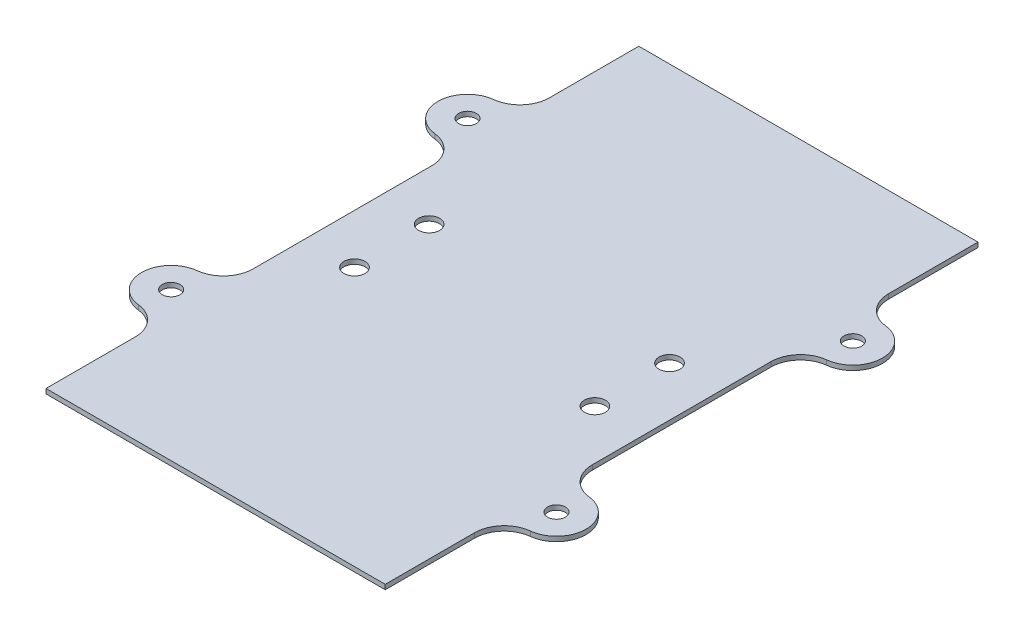
ISO-10303-21;
HEADER;
FILE_DESCRIPTION(('STEP AP214'),'2;1');
FILE_NAME('part.step','',(''),(''),'','','');
FILE_SCHEMA(('AUTOMOTIVE_DESIGN { 1 0 10303 214 1 1 1 1 }'));
ENDSEC;
DATA;
#1=APPLICATION_CONTEXT('core data for automotive mechanical design processes');
#2=APPLICATION_PROTOCOL_DEFINITION('international standard','automotive_design',2000,#1);
#3=PRODUCT_CONTEXT('',#1,'mechanical');
#4=PRODUCT('Part','Part','',(#3));
#5=PRODUCT_RELATED_PRODUCT_CATEGORY('part','',(#4));
#6=PRODUCT_DEFINITION_FORMATION('','',#4);
#7=PRODUCT_DEFINITION_CONTEXT('part definition',#1,'design');
#8=PRODUCT_DEFINITION('design','',#6,#7);
#9=PRODUCT_DEFINITION_SHAPE('','',#8);
#10=(LENGTH_UNIT() NAMED_UNIT(*) SI_UNIT(.MILLI.,.METRE.));
#11=(NAMED_UNIT(*) PLANE_ANGLE_UNIT() SI_UNIT($,.RADIAN.));
#12=(NAMED_UNIT(*) SI_UNIT($,.STERADIAN.) SOLID_ANGLE_UNIT());
#13=UNCERTAINTY_MEASURE_WITH_UNIT(LENGTH_MEASURE(1.E-05),#10,'distance_accuracy_value','');
#14=(GEOMETRIC_REPRESENTATION_CONTEXT(3) GLOBAL_UNCERTAINTY_ASSIGNED_CONTEXT((#13)) GLOBAL_UNIT_ASSIGNED_CONTEXT((#10,
#11,#12)) REPRESENTATION_CONTEXT('',''));
#15=CARTESIAN_POINT('',(0.,0.,0.));
#16=DIRECTION('',(0.,0.,1.));
#17=DIRECTION('',(1.,0.,0.));
#18=AXIS2_PLACEMENT_3D('',#15,#16,#17);
#19=CARTESIAN_POINT('',(-75.3282434819132,1.016,-62.9305095305058));
#20=DIRECTION('',(1.,0.,0.));
#21=DIRECTION('',(0.,0.,-1.));
#22=AXIS2_PLACEMENT_3D('',#19,#20,#21);
#23=PLANE('',#22);
#24=DIRECTION('',(0.,0.,1.));
#25=VECTOR('',#24,1.);
#26=CARTESIAN_POINT('',(-75.3282434819132,1.016,-62.9305095305058));
#27=LINE('',#26,#25);
#28=CARTESIAN_POINT('',(-75.3282434819132,1.016,-18.5593034173802));
#29=VERTEX_POINT('',#28);
#30=CARTESIAN_POINT('',(-75.3282434819132,1.016,19.6982843563685));
#31=VERTEX_POINT('',#30);
#32=EDGE_CURVE('E182',#29,#31,#27,.T.);
#33=ORIENTED_EDGE('',*,*,#32,.F.);
#34=DIRECTION('',(0.,1.,0.));
#35=VECTOR('',#34,1.);
#36=CARTESIAN_POINT('',(-75.3282434819132,1.016,-18.5593034173802));
#37=LINE('',#36,#35);
#38=CARTESIAN_POINT('',(-75.3282434819132,0.,-18.5593034173802));
#39=VERTEX_POINT('',#38);
#40=EDGE_CURVE('E248',#29,#39,#37,.F.);
#41=ORIENTED_EDGE('',*,*,#40,.T.);
#42=DIRECTION('',(0.,0.,1.));
#43=VECTOR('',#42,1.);
#44=CARTESIAN_POINT('',(-75.3282434819132,0.,-62.9305095305058));
#45=LINE('',#44,#43);
#46=CARTESIAN_POINT('',(-75.3282434819132,0.,19.6982843563685));
#47=VERTEX_POINT('',#46);
#48=EDGE_CURVE('E213',#39,#47,#45,.T.);
#49=ORIENTED_EDGE('',*,*,#48,.T.);
#50=DIRECTION('',(0.,1.,0.));
#51=VECTOR('',#50,1.);
#52=CARTESIAN_POINT('',(-75.3282434819132,1.016,19.6982843563685));
#53=LINE('',#52,#51);
#54=EDGE_CURVE('E234',#47,#31,#53,.T.);
#55=ORIENTED_EDGE('',*,*,#54,.T.);
#56=EDGE_LOOP('',(#33,#41,#49,#55));
#57=FACE_BOUND('',#56,.T.);
#58=ADVANCED_FACE('F34',(#57),#23,.F.);
#59=CARTESIAN_POINT('',(-2.65324348191322,1.016,-62.9305095305058));
#60=DIRECTION('',(-1.,0.,0.));
#61=DIRECTION('',(0.,0.,1.));
#62=AXIS2_PLACEMENT_3D('',#59,#60,#61);
#63=PLANE('',#62);
#64=DIRECTION('',(0.,0.,-1.));
#65=VECTOR('',#64,1.);
#66=CARTESIAN_POINT('',(-2.65324348191322,0.,-62.9305095305058));
#67=LINE('',#66,#65);
#68=CARTESIAN_POINT('',(-2.6532434819132,0.,64.0694904694942));
#69=VERTEX_POINT('',#68);
#70=CARTESIAN_POINT('',(-2.65324348191321,0.,44.9406965826198));
#71=VERTEX_POINT('',#70);
#72=EDGE_CURVE('E283',#69,#71,#67,.T.);
#73=ORIENTED_EDGE('',*,*,#72,.T.);
#74=DIRECTION('',(0.,1.,0.));
#75=VECTOR('',#74,1.);
#76=CARTESIAN_POINT('',(-2.65324348191321,1.016,44.9406965826198));
#77=LINE('',#76,#75);
#78=CARTESIAN_POINT('',(-2.65324348191321,1.016,44.9406965826198));
#79=VERTEX_POINT('',#78);
#80=EDGE_CURVE('E357',#71,#79,#77,.T.);
#81=ORIENTED_EDGE('',*,*,#80,.T.);
#82=DIRECTION('',(0.,0.,-1.));
#83=VECTOR('',#82,1.);
#84=CARTESIAN_POINT('',(-2.65324348191322,1.016,-62.9305095305058));
#85=LINE('',#84,#83);
#86=CARTESIAN_POINT('',(-2.6532434819132,1.016,64.0694904694942));
#87=VERTEX_POINT('',#86);
#88=EDGE_CURVE('E281',#87,#79,#85,.T.);
#89=ORIENTED_EDGE('',*,*,#88,.F.);
#90=DIRECTION('',(0.,-1.,0.));
#91=VECTOR('',#90,1.);
#92=CARTESIAN_POINT('',(-2.6532434819132,1.016,64.0694904694942));
#93=LINE('',#92,#91);
#94=EDGE_CURVE('E190',#87,#69,#93,.T.);
#95=ORIENTED_EDGE('',*,*,#94,.T.);
#96=EDGE_LOOP('',(#73,#81,#89,#95));
#97=FACE_BOUND('',#96,.T.);
#98=ADVANCED_FACE('F434',(#97),#63,.F.);
#99=CARTESIAN_POINT('',(-2.65324348191322,1.016,-43.8017156436315));
#100=VERTEX_POINT('',#99);
#101=CARTESIAN_POINT('',(-2.65324348191322,1.016,-62.9305095305058));
#102=VERTEX_POINT('',#101);
#103=EDGE_CURVE('E192',#100,#102,#85,.T.);
#104=ORIENTED_EDGE('',*,*,#103,.F.);
#105=DIRECTION('',(0.,1.,0.));
#106=VECTOR('',#105,1.);
#107=CARTESIAN_POINT('',(-2.65324348191322,1.016,-43.8017156436315));
#108=LINE('',#107,#106);
#109=CARTESIAN_POINT('',(-2.65324348191322,0.,-43.8017156436315));
#110=VERTEX_POINT('',#109);
#111=EDGE_CURVE('E307',#100,#110,#108,.F.);
#112=ORIENTED_EDGE('',*,*,#111,.T.);
#113=CARTESIAN_POINT('',(-2.65324348191322,0.,-62.9305095305058));
#114=VERTEX_POINT('',#113);
#115=EDGE_CURVE('E296',#110,#114,#67,.T.);
#116=ORIENTED_EDGE('',*,*,#115,.T.);
#117=DIRECTION('',(0.,-1.,0.));
#118=VECTOR('',#117,1.);
#119=CARTESIAN_POINT('',(-2.65324348191322,1.016,-62.9305095305058));
#120=LINE('',#119,#118);
#121=EDGE_CURVE('E204',#102,#114,#120,.T.);
#122=ORIENTED_EDGE('',*,*,#121,.F.);
#123=EDGE_LOOP('',(#104,#112,#116,#122));
#124=FACE_BOUND('',#123,.T.);
#125=ADVANCED_FACE('F440',(#124),#63,.F.);
#126=CARTESIAN_POINT('',(-75.3282434819132,1.016,44.9406965826198));
#127=VERTEX_POINT('',#126);
#128=CARTESIAN_POINT('',(-75.3282434819132,1.016,64.0694904694942));
#129=VERTEX_POINT('',#128);
#130=EDGE_CURVE('E170',#127,#129,#27,.T.);
#131=ORIENTED_EDGE('',*,*,#130,.F.);
#132=DIRECTION('',(0.,1.,0.));
#133=VECTOR('',#132,1.);
#134=CARTESIAN_POINT('',(-75.3282434819132,1.016,44.9406965826198));
#135=LINE('',#134,#133);
#136=CARTESIAN_POINT('',(-75.3282434819132,0.,44.9406965826198));
#137=VERTEX_POINT('',#136);
#138=EDGE_CURVE('E245',#127,#137,#135,.F.);
#139=ORIENTED_EDGE('',*,*,#138,.T.);
#140=CARTESIAN_POINT('',(-75.3282434819132,0.,64.0694904694942));
#141=VERTEX_POINT('',#140);
#142=EDGE_CURVE('E197',#137,#141,#45,.T.);
#143=ORIENTED_EDGE('',*,*,#142,.T.);
#144=DIRECTION('',(0.,-1.,0.));
#145=VECTOR('',#144,1.);
#146=CARTESIAN_POINT('',(-75.3282434819132,1.016,64.0694904694942));
#147=LINE('',#146,#145);
#148=EDGE_CURVE('E188',#129,#141,#147,.T.);
#149=ORIENTED_EDGE('',*,*,#148,.F.);
#150=EDGE_LOOP('',(#131,#139,#143,#149));
#151=FACE_BOUND('',#150,.T.);
#152=ADVANCED_FACE('F195',(#151),#23,.F.);
#153=CARTESIAN_POINT('',(-75.3282434819132,0.,-62.9305095305058));
#154=VERTEX_POINT('',#153);
#155=CARTESIAN_POINT('',(-75.3282434819132,0.,-43.8017156436315));
#156=VERTEX_POINT('',#155);
#157=EDGE_CURVE('E208',#154,#156,#45,.T.);
#158=ORIENTED_EDGE('',*,*,#157,.T.);
#159=DIRECTION('',(0.,1.,0.));
#160=VECTOR('',#159,1.);
#161=CARTESIAN_POINT('',(-75.3282434819132,1.016,-43.8017156436315));
#162=LINE('',#161,#160);
#163=CARTESIAN_POINT('',(-75.3282434819132,1.016,-43.8017156436315));
#164=VERTEX_POINT('',#163);
#165=EDGE_CURVE('E199',#156,#164,#162,.T.);
#166=ORIENTED_EDGE('',*,*,#165,.T.);
#167=CARTESIAN_POINT('',(-75.3282434819132,1.016,-62.9305095305058));
#168=VERTEX_POINT('',#167);
#169=EDGE_CURVE('E193',#168,#164,#27,.T.);
#170=ORIENTED_EDGE('',*,*,#169,.F.);
#171=DIRECTION('',(0.,-1.,0.));
#172=VECTOR('',#171,1.);
#173=CARTESIAN_POINT('',(-75.3282434819132,1.016,-62.9305095305058));
#174=LINE('',#173,#172);
#175=EDGE_CURVE('E456',#168,#154,#174,.T.);
#176=ORIENTED_EDGE('',*,*,#175,.T.);
#177=EDGE_LOOP('',(#158,#166,#170,#176));
#178=FACE_BOUND('',#177,.T.);
#179=ADVANCED_FACE('F436',(#178),#23,.F.);
#180=CARTESIAN_POINT('',(-75.3282434819132,1.016,64.0694904694942));
#181=DIRECTION('',(0.,0.,-1.));
#182=DIRECTION('',(-1.,0.,0.));
#183=AXIS2_PLACEMENT_3D('',#180,#181,#182);
#184=PLANE('',#183);
#185=DIRECTION('',(1.,0.,0.));
#186=VECTOR('',#185,1.);
#187=CARTESIAN_POINT('',(-75.3282434819132,0.,64.0694904694942));
#188=LINE('',#187,#186);
#189=EDGE_CURVE('E212',#141,#69,#188,.T.);
#190=ORIENTED_EDGE('',*,*,#189,.T.);
#191=ORIENTED_EDGE('',*,*,#94,.F.);
#192=DIRECTION('',(1.,0.,0.));
#193=VECTOR('',#192,1.);
#194=CARTESIAN_POINT('',(-75.3282434819132,1.016,64.0694904694942));
#195=LINE('',#194,#193);
#196=EDGE_CURVE('E175',#129,#87,#195,.T.);
#197=ORIENTED_EDGE('',*,*,#196,.F.);
#198=ORIENTED_EDGE('',*,*,#148,.T.);
#199=EDGE_LOOP('',(#190,#191,#197,#198));
#200=FACE_BOUND('',#199,.T.);
#201=ADVANCED_FACE('F187',(#200),#184,.F.);
#202=CARTESIAN_POINT('',(-2.65324348191321,0.,19.6982843563685));
#203=VERTEX_POINT('',#202);
#204=CARTESIAN_POINT('',(-2.65324348191321,0.,-18.5593034173802));
#205=VERTEX_POINT('',#204);
#206=EDGE_CURVE('E293',#203,#205,#67,.T.);
#207=ORIENTED_EDGE('',*,*,#206,.T.);
#208=DIRECTION('',(0.,1.,0.));
#209=VECTOR('',#208,1.);
#210=CARTESIAN_POINT('',(-2.65324348191321,1.016,-18.5593034173802));
#211=LINE('',#210,#209);
#212=CARTESIAN_POINT('',(-2.65324348191321,1.016,-18.5593034173802));
#213=VERTEX_POINT('',#212);
#214=EDGE_CURVE('E310',#205,#213,#211,.T.);
#215=ORIENTED_EDGE('',*,*,#214,.T.);
#216=CARTESIAN_POINT('',(-2.65324348191321,1.016,19.6982843563685));
#217=VERTEX_POINT('',#216);
#218=EDGE_CURVE('E282',#217,#213,#85,.T.);
#219=ORIENTED_EDGE('',*,*,#218,.F.);
#220=DIRECTION('',(0.,1.,0.));
#221=VECTOR('',#220,1.);
#222=CARTESIAN_POINT('',(-2.65324348191321,1.016,19.6982843563685));
#223=LINE('',#222,#221);
#224=EDGE_CURVE('E297',#217,#203,#223,.F.);
#225=ORIENTED_EDGE('',*,*,#224,.T.);
#226=EDGE_LOOP('',(#207,#215,#219,#225));
#227=FACE_BOUND('',#226,.T.);
#228=ADVANCED_FACE('F443',(#227),#63,.F.);
#229=CARTESIAN_POINT('',(-75.3282434819132,1.016,-62.9305095305058));
#230=DIRECTION('',(0.,0.,1.));
#231=DIRECTION('',(1.,0.,0.));
#232=AXIS2_PLACEMENT_3D('',#229,#230,#231);
#233=PLANE('',#232);
#234=DIRECTION('',(-1.,0.,0.));
#235=VECTOR('',#234,1.);
#236=CARTESIAN_POINT('',(-75.3282434819132,0.,-62.9305095305058));
#237=LINE('',#236,#235);
#238=EDGE_CURVE('E183',#114,#154,#237,.T.);
#239=ORIENTED_EDGE('',*,*,#238,.T.);
#240=ORIENTED_EDGE('',*,*,#175,.F.);
#241=DIRECTION('',(-1.,0.,0.));
#242=VECTOR('',#241,1.);
#243=CARTESIAN_POINT('',(-75.3282434819132,1.016,-62.9305095305058));
#244=LINE('',#243,#242);
#245=EDGE_CURVE('E219',#102,#168,#244,.T.);
#246=ORIENTED_EDGE('',*,*,#245,.F.);
#247=ORIENTED_EDGE('',*,*,#121,.T.);
#248=EDGE_LOOP('',(#239,#240,#246,#247));
#249=FACE_BOUND('',#248,.T.);
#250=ADVANCED_FACE('F428',(#249),#233,.F.);
#251=CARTESIAN_POINT('',(0.,1.016,0.));
#252=DIRECTION('',(0.,1.,0.));
#253=DIRECTION('',(0.,0.,1.));
#254=AXIS2_PLACEMENT_3D('',#251,#252,#253);
#255=PLANE('',#254);
#256=CARTESIAN_POINT('',(-80.2657434819132,1.016,-31.1805095305058));
#257=DIRECTION('',(0.,1.,0.));
#258=DIRECTION('',(0.,0.,1.));
#259=AXIS2_PLACEMENT_3D('',#256,#257,#258);
#260=CIRCLE('',#259,1.89864999999999);
#261=CARTESIAN_POINT('',(-80.2657434819132,1.016,-29.2818595305058));
#262=VERTEX_POINT('',#261);
#263=EDGE_CURVE('E268',#262,#262,#260,.T.);
#264=ORIENTED_EDGE('',*,*,#263,.F.);
#265=EDGE_LOOP('',(#264));
#266=FACE_BOUND('',#265,.T.);
#267=CARTESIAN_POINT('',(-80.2657434819132,1.016,32.3194904694942));
#268=DIRECTION('',(0.,1.,0.));
#269=DIRECTION('',(0.,0.,1.));
#270=AXIS2_PLACEMENT_3D('',#267,#268,#269);
#271=CIRCLE('',#270,1.89864999999999);
#272=CARTESIAN_POINT('',(-80.2657434819132,1.016,34.2181404694942));
#273=VERTEX_POINT('',#272);
#274=EDGE_CURVE('E267',#273,#273,#271,.T.);
#275=ORIENTED_EDGE('',*,*,#274,.F.);
#276=EDGE_LOOP('',(#275));
#277=FACE_BOUND('',#276,.T.);
#278=CARTESIAN_POINT('',(2.28425651808681,1.016,32.3194904694942));
#279=DIRECTION('',(0.,1.,0.));
#280=DIRECTION('',(0.,0.,1.));
#281=AXIS2_PLACEMENT_3D('',#278,#279,#280);
#282=CIRCLE('',#281,1.89864999999999);
#283=CARTESIAN_POINT('',(2.28425651808681,1.016,34.2181404694942));
#284=VERTEX_POINT('',#283);
#285=EDGE_CURVE('E272',#284,#284,#282,.T.);
#286=ORIENTED_EDGE('',*,*,#285,.F.);
#287=EDGE_LOOP('',(#286));
#288=FACE_BOUND('',#287,.T.);
#289=CARTESIAN_POINT('',(2.28425651808677,1.016,-31.1805095305058));
#290=DIRECTION('',(0.,1.,0.));
#291=DIRECTION('',(0.,0.,1.));
#292=AXIS2_PLACEMENT_3D('',#289,#290,#291);
#293=CIRCLE('',#292,1.89864999999999);
#294=CARTESIAN_POINT('',(2.28425651808677,1.016,-29.2818595305058));
#295=VERTEX_POINT('',#294);
#296=EDGE_CURVE('E276',#295,#295,#293,.T.);
#297=ORIENTED_EDGE('',*,*,#296,.F.);
#298=EDGE_LOOP('',(#297));
#299=FACE_BOUND('',#298,.T.);
#300=CARTESIAN_POINT('',(-13.2407434819132,1.016,8.56949046949416));
#301=DIRECTION('',(0.,-1.,0.));
#302=DIRECTION('',(0.,0.,-1.));
#303=AXIS2_PLACEMENT_3D('',#300,#301,#302);
#304=CIRCLE('',#303,2.25000000000001);
#305=CARTESIAN_POINT('',(-13.2407434819132,1.016,6.31949046949415));
#306=VERTEX_POINT('',#305);
#307=EDGE_CURVE('E394',#306,#306,#304,.T.);
#308=ORIENTED_EDGE('',*,*,#307,.T.);
#309=EDGE_LOOP('',(#308));
#310=FACE_BOUND('',#309,.T.);
#311=CARTESIAN_POINT('',(-13.2407434819132,1.016,-7.43050953050584));
#312=DIRECTION('',(0.,-1.,0.));
#313=DIRECTION('',(0.,0.,-1.));
#314=AXIS2_PLACEMENT_3D('',#311,#312,#313);
#315=CIRCLE('',#314,2.25000000000001);
#316=CARTESIAN_POINT('',(-13.2407434819132,1.016,-9.68050953050585));
#317=VERTEX_POINT('',#316);
#318=EDGE_CURVE('E400',#317,#317,#315,.T.);
#319=ORIENTED_EDGE('',*,*,#318,.T.);
#320=EDGE_LOOP('',(#319));
#321=FACE_BOUND('',#320,.T.);
#322=CARTESIAN_POINT('',(-64.7407434819132,1.016,-7.43050953050583));
#323=DIRECTION('',(0.,-1.,0.));
#324=DIRECTION('',(0.,0.,-1.));
#325=AXIS2_PLACEMENT_3D('',#322,#323,#324);
#326=CIRCLE('',#325,2.25000000000001);
#327=CARTESIAN_POINT('',(-64.7407434819132,1.016,-9.68050953050584));
#328=VERTEX_POINT('',#327);
#329=EDGE_CURVE('E406',#328,#328,#326,.T.);
#330=ORIENTED_EDGE('',*,*,#329,.T.);
#331=EDGE_LOOP('',(#330));
#332=FACE_BOUND('',#331,.T.);
#333=CARTESIAN_POINT('',(-64.7407434819132,1.016,8.56949046949417));
#334=DIRECTION('',(0.,-1.,0.));
#335=DIRECTION('',(0.,0.,-1.));
#336=AXIS2_PLACEMENT_3D('',#333,#334,#335);
#337=CIRCLE('',#336,2.25000000000001);
#338=CARTESIAN_POINT('',(-64.7407434819132,1.016,6.31949046949416));
#339=VERTEX_POINT('',#338);
#340=EDGE_CURVE('E324',#339,#339,#337,.T.);
#341=ORIENTED_EDGE('',*,*,#340,.T.);
#342=EDGE_LOOP('',(#341));
#343=FACE_BOUND('',#342,.T.);
#344=ORIENTED_EDGE('',*,*,#169,.T.);
#345=CARTESIAN_POINT('',(-81.6782434819132,1.016,-43.8017156436315));
#346=DIRECTION('',(0.,1.,0.));
#347=DIRECTION('',(0.,0.,1.));
#348=AXIS2_PLACEMENT_3D('',#345,#346,#347);
#349=CIRCLE('',#348,6.35);
#350=CARTESIAN_POINT('',(-80.9719934819132,1.016,-37.4911125870686));
#351=VERTEX_POINT('',#350);
#352=EDGE_CURVE('E361',#164,#351,#349,.F.);
#353=ORIENTED_EDGE('',*,*,#352,.T.);
#354=CARTESIAN_POINT('',(-80.2657434819132,1.016,-31.1805095305058));
#355=DIRECTION('',(0.,1.,0.));
#356=DIRECTION('',(0.,0.,1.));
#357=AXIS2_PLACEMENT_3D('',#354,#355,#356);
#358=CIRCLE('',#357,6.35);
#359=CARTESIAN_POINT('',(-80.9719934819132,1.016,-24.869906473943));
#360=VERTEX_POINT('',#359);
#361=EDGE_CURVE('E387',#351,#360,#358,.T.);
#362=ORIENTED_EDGE('',*,*,#361,.T.);
#363=CARTESIAN_POINT('',(-81.6782434819132,1.016,-18.5593034173802));
#364=DIRECTION('',(0.,1.,0.));
#365=DIRECTION('',(0.,0.,1.));
#366=AXIS2_PLACEMENT_3D('',#363,#364,#365);
#367=CIRCLE('',#366,6.35);
#368=EDGE_CURVE('E365',#360,#29,#367,.F.);
#369=ORIENTED_EDGE('',*,*,#368,.T.);
#370=ORIENTED_EDGE('',*,*,#32,.T.);
#371=CARTESIAN_POINT('',(-81.6782434819132,1.016,19.6982843563685));
#372=DIRECTION('',(0.,1.,0.));
#373=DIRECTION('',(0.,0.,1.));
#374=AXIS2_PLACEMENT_3D('',#371,#372,#373);
#375=CIRCLE('',#374,6.35);
#376=CARTESIAN_POINT('',(-80.9719934819132,1.016,26.0088874129314));
#377=VERTEX_POINT('',#376);
#378=EDGE_CURVE('E369',#31,#377,#375,.F.);
#379=ORIENTED_EDGE('',*,*,#378,.T.);
#380=CARTESIAN_POINT('',(-80.2657434819132,1.016,32.3194904694942));
#381=DIRECTION('',(0.,1.,0.));
#382=DIRECTION('',(0.,0.,-1.));
#383=AXIS2_PLACEMENT_3D('',#380,#381,#382);
#384=CIRCLE('',#383,6.35);
#385=CARTESIAN_POINT('',(-80.9719934819132,1.016,38.630093526057));
#386=VERTEX_POINT('',#385);
#387=EDGE_CURVE('E280',#377,#386,#384,.T.);
#388=ORIENTED_EDGE('',*,*,#387,.T.);
#389=CARTESIAN_POINT('',(-81.6782434819132,1.016,44.9406965826198));
#390=DIRECTION('',(0.,1.,0.));
#391=DIRECTION('',(0.,0.,1.));
#392=AXIS2_PLACEMENT_3D('',#389,#390,#391);
#393=CIRCLE('',#392,6.35);
#394=EDGE_CURVE('E178',#386,#127,#393,.F.);
#395=ORIENTED_EDGE('',*,*,#394,.T.);
#396=ORIENTED_EDGE('',*,*,#130,.T.);
#397=ORIENTED_EDGE('',*,*,#196,.T.);
#398=ORIENTED_EDGE('',*,*,#88,.T.);
#399=CARTESIAN_POINT('',(3.69675651808679,1.016,44.9406965826198));
#400=DIRECTION('',(0.,1.,0.));
#401=DIRECTION('',(0.,0.,1.));
#402=AXIS2_PLACEMENT_3D('',#399,#400,#401);
#403=CIRCLE('',#402,6.35);
#404=CARTESIAN_POINT('',(2.9905065180868,1.016,38.630093526057));
#405=VERTEX_POINT('',#404);
#406=EDGE_CURVE('E42',#79,#405,#403,.F.);
#407=ORIENTED_EDGE('',*,*,#406,.T.);
#408=CARTESIAN_POINT('',(2.28425651808681,1.016,32.3194904694942));
#409=DIRECTION('',(0.,1.,0.));
#410=DIRECTION('',(0.,0.,1.));
#411=AXIS2_PLACEMENT_3D('',#408,#409,#410);
#412=CIRCLE('',#411,6.35);
#413=CARTESIAN_POINT('',(2.9905065180868,1.016,26.0088874129314));
#414=VERTEX_POINT('',#413);
#415=EDGE_CURVE('E345',#405,#414,#412,.T.);
#416=ORIENTED_EDGE('',*,*,#415,.T.);
#417=CARTESIAN_POINT('',(3.69675651808679,1.016,19.6982843563685));
#418=DIRECTION('',(0.,1.,0.));
#419=DIRECTION('',(0.,0.,1.));
#420=AXIS2_PLACEMENT_3D('',#417,#418,#419);
#421=CIRCLE('',#420,6.35);
#422=EDGE_CURVE('E340',#414,#217,#421,.F.);
#423=ORIENTED_EDGE('',*,*,#422,.T.);
#424=ORIENTED_EDGE('',*,*,#218,.T.);
#425=CARTESIAN_POINT('',(3.69675651808679,1.016,-18.5593034173802));
#426=DIRECTION('',(0.,1.,0.));
#427=DIRECTION('',(0.,0.,1.));
#428=AXIS2_PLACEMENT_3D('',#425,#426,#427);
#429=CIRCLE('',#428,6.35);
#430=CARTESIAN_POINT('',(2.99050651808678,1.016,-24.869906473943));
#431=VERTEX_POINT('',#430);
#432=EDGE_CURVE('E327',#213,#431,#429,.F.);
#433=ORIENTED_EDGE('',*,*,#432,.T.);
#434=CARTESIAN_POINT('',(2.28425651808677,1.016,-31.1805095305058));
#435=DIRECTION('',(0.,1.,0.));
#436=DIRECTION('',(0.,0.,-1.));
#437=AXIS2_PLACEMENT_3D('',#434,#435,#436);
#438=CIRCLE('',#437,6.35);
#439=CARTESIAN_POINT('',(2.99050651808677,1.016,-37.4911125870686));
#440=VERTEX_POINT('',#439);
#441=EDGE_CURVE('E382',#431,#440,#438,.T.);
#442=ORIENTED_EDGE('',*,*,#441,.T.);
#443=CARTESIAN_POINT('',(3.69675651808678,1.016,-43.8017156436315));
#444=DIRECTION('',(0.,1.,0.));
#445=DIRECTION('',(0.,0.,1.));
#446=AXIS2_PLACEMENT_3D('',#443,#444,#445);
#447=CIRCLE('',#446,6.35);
#448=EDGE_CURVE('E336',#440,#100,#447,.F.);
#449=ORIENTED_EDGE('',*,*,#448,.T.);
#450=ORIENTED_EDGE('',*,*,#103,.T.);
#451=ORIENTED_EDGE('',*,*,#245,.T.);
#452=EDGE_LOOP('',(#344,#353,#362,#369,#370,#379,#388,#395,#396,#397,#398,#407,#416,#423,#424,
#433,#442,#449,#450,#451));
#453=FACE_BOUND('',#452,.T.);
#454=ADVANCED_FACE('F173',(#266,#277,#288,#299,#310,#321,#332,#343,#453),#255,.T.);
#455=CARTESIAN_POINT('',(0.,0.,0.));
#456=DIRECTION('',(0.,1.,0.));
#457=DIRECTION('',(0.,0.,1.));
#458=AXIS2_PLACEMENT_3D('',#455,#456,#457);
#459=PLANE('',#458);
#460=CARTESIAN_POINT('',(-80.2657434819132,0.,-31.1805095305058));
#461=DIRECTION('',(0.,1.,0.));
#462=DIRECTION('',(0.,0.,1.));
#463=AXIS2_PLACEMENT_3D('',#460,#461,#462);
#464=CIRCLE('',#463,1.89864999999999);
#465=CARTESIAN_POINT('',(-80.2657434819132,0.,-29.2818595305058));
#466=VERTEX_POINT('',#465);
#467=EDGE_CURVE('E264',#466,#466,#464,.T.);
#468=ORIENTED_EDGE('',*,*,#467,.T.);
#469=EDGE_LOOP('',(#468));
#470=FACE_BOUND('',#469,.T.);
#471=CARTESIAN_POINT('',(-80.2657434819132,0.,32.3194904694942));
#472=DIRECTION('',(0.,1.,0.));
#473=DIRECTION('',(0.,0.,1.));
#474=AXIS2_PLACEMENT_3D('',#471,#472,#473);
#475=CIRCLE('',#474,1.89864999999999);
#476=CARTESIAN_POINT('',(-80.2657434819132,0.,34.2181404694942));
#477=VERTEX_POINT('',#476);
#478=EDGE_CURVE('E269',#477,#477,#475,.T.);
#479=ORIENTED_EDGE('',*,*,#478,.T.);
#480=EDGE_LOOP('',(#479));
#481=FACE_BOUND('',#480,.T.);
#482=CARTESIAN_POINT('',(2.28425651808681,0.,32.3194904694942));
#483=DIRECTION('',(0.,1.,0.));
#484=DIRECTION('',(0.,0.,1.));
#485=AXIS2_PLACEMENT_3D('',#482,#483,#484);
#486=CIRCLE('',#485,1.89864999999999);
#487=CARTESIAN_POINT('',(2.28425651808681,0.,34.2181404694942));
#488=VERTEX_POINT('',#487);
#489=EDGE_CURVE('E273',#488,#488,#486,.T.);
#490=ORIENTED_EDGE('',*,*,#489,.T.);
#491=EDGE_LOOP('',(#490));
#492=FACE_BOUND('',#491,.T.);
#493=CARTESIAN_POINT('',(2.28425651808677,0.,-31.1805095305058));
#494=DIRECTION('',(0.,1.,0.));
#495=DIRECTION('',(0.,0.,1.));
#496=AXIS2_PLACEMENT_3D('',#493,#494,#495);
#497=CIRCLE('',#496,1.89864999999999);
#498=CARTESIAN_POINT('',(2.28425651808677,0.,-29.2818595305058));
#499=VERTEX_POINT('',#498);
#500=EDGE_CURVE('E277',#499,#499,#497,.T.);
#501=ORIENTED_EDGE('',*,*,#500,.T.);
#502=EDGE_LOOP('',(#501));
#503=FACE_BOUND('',#502,.T.);
#504=CARTESIAN_POINT('',(-13.2407434819132,0.,8.56949046949416));
#505=DIRECTION('',(0.,-1.,0.));
#506=DIRECTION('',(0.,0.,-1.));
#507=AXIS2_PLACEMENT_3D('',#504,#505,#506);
#508=CIRCLE('',#507,2.25000000000001);
#509=CARTESIAN_POINT('',(-13.2407434819132,0.,6.31949046949415));
#510=VERTEX_POINT('',#509);
#511=EDGE_CURVE('E392',#510,#510,#508,.T.);
#512=ORIENTED_EDGE('',*,*,#511,.F.);
#513=EDGE_LOOP('',(#512));
#514=FACE_BOUND('',#513,.T.);
#515=CARTESIAN_POINT('',(-13.2407434819132,0.,-7.43050953050584));
#516=DIRECTION('',(0.,-1.,0.));
#517=DIRECTION('',(0.,0.,-1.));
#518=AXIS2_PLACEMENT_3D('',#515,#516,#517);
#519=CIRCLE('',#518,2.25000000000001);
#520=CARTESIAN_POINT('',(-13.2407434819132,0.,-9.68050953050585));
#521=VERTEX_POINT('',#520);
#522=EDGE_CURVE('E397',#521,#521,#519,.T.);
#523=ORIENTED_EDGE('',*,*,#522,.F.);
#524=EDGE_LOOP('',(#523));
#525=FACE_BOUND('',#524,.T.);
#526=CARTESIAN_POINT('',(-64.7407434819132,0.,-7.43050953050583));
#527=DIRECTION('',(0.,-1.,0.));
#528=DIRECTION('',(0.,0.,-1.));
#529=AXIS2_PLACEMENT_3D('',#526,#527,#528);
#530=CIRCLE('',#529,2.25000000000001);
#531=CARTESIAN_POINT('',(-64.7407434819132,0.,-9.68050953050584));
#532=VERTEX_POINT('',#531);
#533=EDGE_CURVE('E403',#532,#532,#530,.T.);
#534=ORIENTED_EDGE('',*,*,#533,.F.);
#535=EDGE_LOOP('',(#534));
#536=FACE_BOUND('',#535,.T.);
#537=CARTESIAN_POINT('',(-64.7407434819132,0.,8.56949046949417));
#538=DIRECTION('',(0.,-1.,0.));
#539=DIRECTION('',(0.,0.,-1.));
#540=AXIS2_PLACEMENT_3D('',#537,#538,#539);
#541=CIRCLE('',#540,2.25000000000001);
#542=CARTESIAN_POINT('',(-64.7407434819132,0.,6.31949046949416));
#543=VERTEX_POINT('',#542);
#544=EDGE_CURVE('E238',#543,#543,#541,.T.);
#545=ORIENTED_EDGE('',*,*,#544,.F.);
#546=EDGE_LOOP('',(#545));
#547=FACE_BOUND('',#546,.T.);
#548=ORIENTED_EDGE('',*,*,#157,.F.);
#549=ORIENTED_EDGE('',*,*,#238,.F.);
#550=ORIENTED_EDGE('',*,*,#115,.F.);
#551=CARTESIAN_POINT('',(3.69675651808678,0.,-43.8017156436315));
#552=DIRECTION('',(0.,1.,0.));
#553=DIRECTION('',(0.,0.,1.));
#554=AXIS2_PLACEMENT_3D('',#551,#552,#553);
#555=CIRCLE('',#554,6.35);
#556=CARTESIAN_POINT('',(2.99050651808677,0.,-37.4911125870686));
#557=VERTEX_POINT('',#556);
#558=EDGE_CURVE('E338',#110,#557,#555,.T.);
#559=ORIENTED_EDGE('',*,*,#558,.T.);
#560=CARTESIAN_POINT('',(2.28425651808677,0.,-31.1805095305058));
#561=DIRECTION('',(0.,1.,0.));
#562=DIRECTION('',(0.,0.,1.));
#563=AXIS2_PLACEMENT_3D('',#560,#561,#562);
#564=CIRCLE('',#563,6.35);
#565=CARTESIAN_POINT('',(2.99050651808678,0.,-24.869906473943));
#566=VERTEX_POINT('',#565);
#567=EDGE_CURVE('E384',#557,#566,#564,.F.);
#568=ORIENTED_EDGE('',*,*,#567,.T.);
#569=CARTESIAN_POINT('',(3.69675651808679,0.,-18.5593034173802));
#570=DIRECTION('',(0.,1.,0.));
#571=DIRECTION('',(0.,0.,1.));
#572=AXIS2_PLACEMENT_3D('',#569,#570,#571);
#573=CIRCLE('',#572,6.35);
#574=EDGE_CURVE('E329',#566,#205,#573,.T.);
#575=ORIENTED_EDGE('',*,*,#574,.T.);
#576=ORIENTED_EDGE('',*,*,#206,.F.);
#577=CARTESIAN_POINT('',(3.69675651808679,0.,19.6982843563685));
#578=DIRECTION('',(0.,1.,0.));
#579=DIRECTION('',(0.,0.,1.));
#580=AXIS2_PLACEMENT_3D('',#577,#578,#579);
#581=CIRCLE('',#580,6.35);
#582=CARTESIAN_POINT('',(2.9905065180868,0.,26.0088874129314));
#583=VERTEX_POINT('',#582);
#584=EDGE_CURVE('E342',#203,#583,#581,.T.);
#585=ORIENTED_EDGE('',*,*,#584,.T.);
#586=CARTESIAN_POINT('',(2.28425651808681,0.,32.3194904694942));
#587=DIRECTION('',(0.,1.,0.));
#588=DIRECTION('',(0.,0.,1.));
#589=AXIS2_PLACEMENT_3D('',#586,#587,#588);
#590=CIRCLE('',#589,6.35);
#591=CARTESIAN_POINT('',(2.9905065180868,0.,38.630093526057));
#592=VERTEX_POINT('',#591);
#593=EDGE_CURVE('E353',#583,#592,#590,.F.);
#594=ORIENTED_EDGE('',*,*,#593,.T.);
#595=CARTESIAN_POINT('',(3.69675651808679,0.,44.9406965826198));
#596=DIRECTION('',(0.,1.,0.));
#597=DIRECTION('',(0.,0.,1.));
#598=AXIS2_PLACEMENT_3D('',#595,#596,#597);
#599=CIRCLE('',#598,6.35);
#600=EDGE_CURVE('E11',#592,#71,#599,.T.);
#601=ORIENTED_EDGE('',*,*,#600,.T.);
#602=ORIENTED_EDGE('',*,*,#72,.F.);
#603=ORIENTED_EDGE('',*,*,#189,.F.);
#604=ORIENTED_EDGE('',*,*,#142,.F.);
#605=CARTESIAN_POINT('',(-81.6782434819132,0.,44.9406965826198));
#606=DIRECTION('',(0.,1.,0.));
#607=DIRECTION('',(0.,0.,1.));
#608=AXIS2_PLACEMENT_3D('',#605,#606,#607);
#609=CIRCLE('',#608,6.35);
#610=CARTESIAN_POINT('',(-80.9719934819132,0.,38.630093526057));
#611=VERTEX_POINT('',#610);
#612=EDGE_CURVE('E322',#137,#611,#609,.T.);
#613=ORIENTED_EDGE('',*,*,#612,.T.);
#614=CARTESIAN_POINT('',(-80.2657434819132,0.,32.3194904694942));
#615=DIRECTION('',(0.,1.,0.));
#616=DIRECTION('',(0.,0.,1.));
#617=AXIS2_PLACEMENT_3D('',#614,#615,#616);
#618=CIRCLE('',#617,6.35);
#619=CARTESIAN_POINT('',(-80.9719934819132,0.,26.0088874129314));
#620=VERTEX_POINT('',#619);
#621=EDGE_CURVE('E354',#611,#620,#618,.F.);
#622=ORIENTED_EDGE('',*,*,#621,.T.);
#623=CARTESIAN_POINT('',(-81.6782434819132,0.,19.6982843563685));
#624=DIRECTION('',(0.,1.,0.));
#625=DIRECTION('',(0.,0.,1.));
#626=AXIS2_PLACEMENT_3D('',#623,#624,#625);
#627=CIRCLE('',#626,6.35);
#628=EDGE_CURVE('E331',#620,#47,#627,.T.);
#629=ORIENTED_EDGE('',*,*,#628,.T.);
#630=ORIENTED_EDGE('',*,*,#48,.F.);
#631=CARTESIAN_POINT('',(-81.6782434819132,0.,-18.5593034173802));
#632=DIRECTION('',(0.,1.,0.));
#633=DIRECTION('',(0.,0.,1.));
#634=AXIS2_PLACEMENT_3D('',#631,#632,#633);
#635=CIRCLE('',#634,6.35);
#636=CARTESIAN_POINT('',(-80.9719934819132,0.,-24.869906473943));
#637=VERTEX_POINT('',#636);
#638=EDGE_CURVE('E367',#39,#637,#635,.T.);
#639=ORIENTED_EDGE('',*,*,#638,.T.);
#640=CARTESIAN_POINT('',(-80.2657434819132,0.,-31.1805095305058));
#641=DIRECTION('',(0.,1.,0.));
#642=DIRECTION('',(0.,0.,1.));
#643=AXIS2_PLACEMENT_3D('',#640,#641,#642);
#644=CIRCLE('',#643,6.35);
#645=CARTESIAN_POINT('',(-80.9719934819132,0.,-37.4911125870686));
#646=VERTEX_POINT('',#645);
#647=EDGE_CURVE('E390',#637,#646,#644,.F.);
#648=ORIENTED_EDGE('',*,*,#647,.T.);
#649=CARTESIAN_POINT('',(-81.6782434819132,0.,-43.8017156436315));
#650=DIRECTION('',(0.,1.,0.));
#651=DIRECTION('',(0.,0.,1.));
#652=AXIS2_PLACEMENT_3D('',#649,#650,#651);
#653=CIRCLE('',#652,6.35);
#654=EDGE_CURVE('E363',#646,#156,#653,.T.);
#655=ORIENTED_EDGE('',*,*,#654,.T.);
#656=EDGE_LOOP('',(#548,#549,#550,#559,#568,#575,#576,#585,#594,#601,#602,#603,#604,#613,#622,
#629,#630,#639,#648,#655));
#657=FACE_BOUND('',#656,.T.);
#658=ADVANCED_FACE('F320',(#470,#481,#492,#503,#514,#525,#536,#547,#657),#459,.F.);
#659=CARTESIAN_POINT('',(-64.7407434819132,1.016,8.56949046949417));
#660=DIRECTION('',(0.,-1.,0.));
#661=DIRECTION('',(0.,0.,-1.));
#662=AXIS2_PLACEMENT_3D('',#659,#660,#661);
#663=CYLINDRICAL_SURFACE('',#662,2.25000000000001);
#664=ORIENTED_EDGE('',*,*,#340,.F.);
#665=EDGE_LOOP('',(#664));
#666=FACE_BOUND('',#665,.T.);
#667=ORIENTED_EDGE('',*,*,#544,.T.);
#668=EDGE_LOOP('',(#667));
#669=FACE_BOUND('',#668,.T.);
#670=ADVANCED_FACE('F416',(#666,#669),#663,.F.);
#671=CARTESIAN_POINT('',(-64.7407434819132,1.016,-7.43050953050583));
#672=DIRECTION('',(0.,-1.,0.));
#673=DIRECTION('',(0.,0.,-1.));
#674=AXIS2_PLACEMENT_3D('',#671,#672,#673);
#675=CYLINDRICAL_SURFACE('',#674,2.25000000000001);
#676=ORIENTED_EDGE('',*,*,#329,.F.);
#677=EDGE_LOOP('',(#676));
#678=FACE_BOUND('',#677,.T.);
#679=ORIENTED_EDGE('',*,*,#533,.T.);
#680=EDGE_LOOP('',(#679));
#681=FACE_BOUND('',#680,.T.);
#682=ADVANCED_FACE('F425',(#678,#681),#675,.F.);
#683=CARTESIAN_POINT('',(-13.2407434819132,1.016,-7.43050953050584));
#684=DIRECTION('',(0.,-1.,0.));
#685=DIRECTION('',(0.,0.,-1.));
#686=AXIS2_PLACEMENT_3D('',#683,#684,#685);
#687=CYLINDRICAL_SURFACE('',#686,2.25000000000001);
#688=ORIENTED_EDGE('',*,*,#318,.F.);
#689=EDGE_LOOP('',(#688));
#690=FACE_BOUND('',#689,.T.);
#691=ORIENTED_EDGE('',*,*,#522,.T.);
#692=EDGE_LOOP('',(#691));
#693=FACE_BOUND('',#692,.T.);
#694=ADVANCED_FACE('F472',(#690,#693),#687,.F.);
#695=CARTESIAN_POINT('',(-13.2407434819132,1.016,8.56949046949416));
#696=DIRECTION('',(0.,-1.,0.));
#697=DIRECTION('',(0.,0.,-1.));
#698=AXIS2_PLACEMENT_3D('',#695,#696,#697);
#699=CYLINDRICAL_SURFACE('',#698,2.25000000000001);
#700=ORIENTED_EDGE('',*,*,#307,.F.);
#701=EDGE_LOOP('',(#700));
#702=FACE_BOUND('',#701,.T.);
#703=ORIENTED_EDGE('',*,*,#511,.T.);
#704=EDGE_LOOP('',(#703));
#705=FACE_BOUND('',#704,.T.);
#706=ADVANCED_FACE('F464',(#702,#705),#699,.F.);
#707=CARTESIAN_POINT('',(-80.2657434819132,-16.9911052097855,-31.1805095305058));
#708=DIRECTION('',(0.,1.,0.));
#709=DIRECTION('',(0.,0.,1.));
#710=AXIS2_PLACEMENT_3D('',#707,#708,#709);
#711=CYLINDRICAL_SURFACE('',#710,6.35);
#712=ORIENTED_EDGE('',*,*,#361,.F.);
#713=DIRECTION('',(0.,1.,0.));
#714=VECTOR('',#713,1.);
#715=CARTESIAN_POINT('',(-80.9719934819132,-16.9911052097855,-37.4911125870686));
#716=LINE('',#715,#714);
#717=EDGE_CURVE('E230',#351,#646,#716,.F.);
#718=ORIENTED_EDGE('',*,*,#717,.T.);
#719=ORIENTED_EDGE('',*,*,#647,.F.);
#720=DIRECTION('',(0.,1.,0.));
#721=VECTOR('',#720,1.);
#722=CARTESIAN_POINT('',(-80.9719934819132,-16.9911052097855,-24.869906473943));
#723=LINE('',#722,#721);
#724=EDGE_CURVE('E202',#637,#360,#723,.T.);
#725=ORIENTED_EDGE('',*,*,#724,.T.);
#726=EDGE_LOOP('',(#712,#718,#719,#725));
#727=FACE_BOUND('',#726,.T.);
#728=ADVANCED_FACE('F461',(#727),#711,.T.);
#729=CARTESIAN_POINT('',(2.28425651808677,-16.9911052097855,-31.1805095305058));
#730=DIRECTION('',(0.,1.,0.));
#731=DIRECTION('',(0.,0.,1.));
#732=AXIS2_PLACEMENT_3D('',#729,#730,#731);
#733=CYLINDRICAL_SURFACE('',#732,6.35);
#734=ORIENTED_EDGE('',*,*,#441,.F.);
#735=DIRECTION('',(0.,1.,0.));
#736=VECTOR('',#735,1.);
#737=CARTESIAN_POINT('',(2.99050651808678,-16.9911052097855,-24.869906473943));
#738=LINE('',#737,#736);
#739=EDGE_CURVE('E305',#431,#566,#738,.F.);
#740=ORIENTED_EDGE('',*,*,#739,.T.);
#741=ORIENTED_EDGE('',*,*,#567,.F.);
#742=DIRECTION('',(0.,1.,0.));
#743=VECTOR('',#742,1.);
#744=CARTESIAN_POINT('',(2.99050651808677,-16.9911052097855,-37.4911125870686));
#745=LINE('',#744,#743);
#746=EDGE_CURVE('E308',#557,#440,#745,.T.);
#747=ORIENTED_EDGE('',*,*,#746,.T.);
#748=EDGE_LOOP('',(#734,#740,#741,#747));
#749=FACE_BOUND('',#748,.T.);
#750=ADVANCED_FACE('F463',(#749),#733,.T.);
#751=CARTESIAN_POINT('',(2.28425651808681,-16.9911052097855,32.3194904694942));
#752=DIRECTION('',(0.,1.,0.));
#753=DIRECTION('',(0.,0.,1.));
#754=AXIS2_PLACEMENT_3D('',#751,#752,#753);
#755=CYLINDRICAL_SURFACE('',#754,6.35);
#756=ORIENTED_EDGE('',*,*,#593,.F.);
#757=DIRECTION('',(0.,1.,0.));
#758=VECTOR('',#757,1.);
#759=CARTESIAN_POINT('',(2.9905065180868,-16.9911052097855,26.0088874129314));
#760=LINE('',#759,#758);
#761=EDGE_CURVE('E352',#583,#414,#760,.T.);
#762=ORIENTED_EDGE('',*,*,#761,.T.);
#763=ORIENTED_EDGE('',*,*,#415,.F.);
#764=DIRECTION('',(0.,1.,0.));
#765=VECTOR('',#764,1.);
#766=CARTESIAN_POINT('',(2.9905065180868,-16.9911052097855,38.630093526057));
#767=LINE('',#766,#765);
#768=EDGE_CURVE('E350',#405,#592,#767,.F.);
#769=ORIENTED_EDGE('',*,*,#768,.T.);
#770=EDGE_LOOP('',(#756,#762,#763,#769));
#771=FACE_BOUND('',#770,.T.);
#772=ADVANCED_FACE('F349',(#771),#755,.T.);
#773=CARTESIAN_POINT('',(-80.2657434819132,-16.9911052097855,32.3194904694942));
#774=DIRECTION('',(0.,1.,0.));
#775=DIRECTION('',(0.,0.,1.));
#776=AXIS2_PLACEMENT_3D('',#773,#774,#775);
#777=CYLINDRICAL_SURFACE('',#776,6.35);
#778=ORIENTED_EDGE('',*,*,#387,.F.);
#779=DIRECTION('',(0.,1.,0.));
#780=VECTOR('',#779,1.);
#781=CARTESIAN_POINT('',(-80.9719934819132,-16.9911052097855,26.0088874129314));
#782=LINE('',#781,#780);
#783=EDGE_CURVE('E243',#377,#620,#782,.F.);
#784=ORIENTED_EDGE('',*,*,#783,.T.);
#785=ORIENTED_EDGE('',*,*,#621,.F.);
#786=DIRECTION('',(0.,1.,0.));
#787=VECTOR('',#786,1.);
#788=CARTESIAN_POINT('',(-80.9719934819132,-16.9911052097855,38.630093526057));
#789=LINE('',#788,#787);
#790=EDGE_CURVE('E246',#611,#386,#789,.T.);
#791=ORIENTED_EDGE('',*,*,#790,.T.);
#792=EDGE_LOOP('',(#778,#784,#785,#791));
#793=FACE_BOUND('',#792,.T.);
#794=ADVANCED_FACE('F377',(#793),#777,.T.);
#795=CARTESIAN_POINT('',(2.28425651808677,1.016,-31.1805095305058));
#796=DIRECTION('',(0.,1.,0.));
#797=DIRECTION('',(0.,0.,1.));
#798=AXIS2_PLACEMENT_3D('',#795,#796,#797);
#799=CYLINDRICAL_SURFACE('',#798,1.89864999999999);
#800=ORIENTED_EDGE('',*,*,#296,.T.);
#801=EDGE_LOOP('',(#800));
#802=FACE_BOUND('',#801,.T.);
#803=ORIENTED_EDGE('',*,*,#500,.F.);
#804=EDGE_LOOP('',(#803));
#805=FACE_BOUND('',#804,.T.);
#806=ADVANCED_FACE('F505',(#802,#805),#799,.F.);
#807=CARTESIAN_POINT('',(2.28425651808681,1.016,32.3194904694942));
#808=DIRECTION('',(0.,1.,0.));
#809=DIRECTION('',(0.,0.,1.));
#810=AXIS2_PLACEMENT_3D('',#807,#808,#809);
#811=CYLINDRICAL_SURFACE('',#810,1.89864999999999);
#812=ORIENTED_EDGE('',*,*,#285,.T.);
#813=EDGE_LOOP('',(#812));
#814=FACE_BOUND('',#813,.T.);
#815=ORIENTED_EDGE('',*,*,#489,.F.);
#816=EDGE_LOOP('',(#815));
#817=FACE_BOUND('',#816,.T.);
#818=ADVANCED_FACE('F510',(#814,#817),#811,.F.);
#819=CARTESIAN_POINT('',(-80.2657434819132,1.016,32.3194904694942));
#820=DIRECTION('',(0.,1.,0.));
#821=DIRECTION('',(0.,0.,1.));
#822=AXIS2_PLACEMENT_3D('',#819,#820,#821);
#823=CYLINDRICAL_SURFACE('',#822,1.89864999999999);
#824=ORIENTED_EDGE('',*,*,#274,.T.);
#825=EDGE_LOOP('',(#824));
#826=FACE_BOUND('',#825,.T.);
#827=ORIENTED_EDGE('',*,*,#478,.F.);
#828=EDGE_LOOP('',(#827));
#829=FACE_BOUND('',#828,.T.);
#830=ADVANCED_FACE('F522',(#826,#829),#823,.F.);
#831=CARTESIAN_POINT('',(-80.2657434819132,1.016,-31.1805095305058));
#832=DIRECTION('',(0.,1.,0.));
#833=DIRECTION('',(0.,0.,1.));
#834=AXIS2_PLACEMENT_3D('',#831,#832,#833);
#835=CYLINDRICAL_SURFACE('',#834,1.89864999999999);
#836=ORIENTED_EDGE('',*,*,#263,.T.);
#837=EDGE_LOOP('',(#836));
#838=FACE_BOUND('',#837,.T.);
#839=ORIENTED_EDGE('',*,*,#467,.F.);
#840=EDGE_LOOP('',(#839));
#841=FACE_BOUND('',#840,.T.);
#842=ADVANCED_FACE('F532',(#838,#841),#835,.F.);
#843=CARTESIAN_POINT('',(-81.6782434819132,-16.9911052097855,-43.8017156436315));
#844=DIRECTION('',(0.,1.,0.));
#845=DIRECTION('',(0.,0.,1.));
#846=AXIS2_PLACEMENT_3D('',#843,#844,#845);
#847=CYLINDRICAL_SURFACE('',#846,6.35);
#848=ORIENTED_EDGE('',*,*,#654,.F.);
#849=ORIENTED_EDGE('',*,*,#717,.F.);
#850=ORIENTED_EDGE('',*,*,#352,.F.);
#851=ORIENTED_EDGE('',*,*,#165,.F.);
#852=EDGE_LOOP('',(#848,#849,#850,#851));
#853=FACE_BOUND('',#852,.T.);
#854=ADVANCED_FACE('F460',(#853),#847,.F.);
#855=CARTESIAN_POINT('',(-81.6782434819132,-16.9911052097855,-18.5593034173802));
#856=DIRECTION('',(0.,1.,0.));
#857=DIRECTION('',(0.,0.,1.));
#858=AXIS2_PLACEMENT_3D('',#855,#856,#857);
#859=CYLINDRICAL_SURFACE('',#858,6.35);
#860=ORIENTED_EDGE('',*,*,#638,.F.);
#861=ORIENTED_EDGE('',*,*,#40,.F.);
#862=ORIENTED_EDGE('',*,*,#368,.F.);
#863=ORIENTED_EDGE('',*,*,#724,.F.);
#864=EDGE_LOOP('',(#860,#861,#862,#863));
#865=FACE_BOUND('',#864,.T.);
#866=ADVANCED_FACE('F625',(#865),#859,.F.);
#867=CARTESIAN_POINT('',(-81.6782434819132,-16.9911052097855,19.6982843563685));
#868=DIRECTION('',(0.,1.,0.));
#869=DIRECTION('',(0.,0.,1.));
#870=AXIS2_PLACEMENT_3D('',#867,#868,#869);
#871=CYLINDRICAL_SURFACE('',#870,6.35);
#872=ORIENTED_EDGE('',*,*,#628,.F.);
#873=ORIENTED_EDGE('',*,*,#783,.F.);
#874=ORIENTED_EDGE('',*,*,#378,.F.);
#875=ORIENTED_EDGE('',*,*,#54,.F.);
#876=EDGE_LOOP('',(#872,#873,#874,#875));
#877=FACE_BOUND('',#876,.T.);
#878=ADVANCED_FACE('F374',(#877),#871,.F.);
#879=CARTESIAN_POINT('',(-81.6782434819132,-16.9911052097855,44.9406965826198));
#880=DIRECTION('',(0.,1.,0.));
#881=DIRECTION('',(0.,0.,1.));
#882=AXIS2_PLACEMENT_3D('',#879,#880,#881);
#883=CYLINDRICAL_SURFACE('',#882,6.35);
#884=ORIENTED_EDGE('',*,*,#612,.F.);
#885=ORIENTED_EDGE('',*,*,#138,.F.);
#886=ORIENTED_EDGE('',*,*,#394,.F.);
#887=ORIENTED_EDGE('',*,*,#790,.F.);
#888=EDGE_LOOP('',(#884,#885,#886,#887));
#889=FACE_BOUND('',#888,.T.);
#890=ADVANCED_FACE('F326',(#889),#883,.F.);
#891=CARTESIAN_POINT('',(3.69675651808679,-16.9911052097855,-18.5593034173802));
#892=DIRECTION('',(0.,1.,0.));
#893=DIRECTION('',(0.,0.,1.));
#894=AXIS2_PLACEMENT_3D('',#891,#892,#893);
#895=CYLINDRICAL_SURFACE('',#894,6.35);
#896=ORIENTED_EDGE('',*,*,#574,.F.);
#897=ORIENTED_EDGE('',*,*,#739,.F.);
#898=ORIENTED_EDGE('',*,*,#432,.F.);
#899=ORIENTED_EDGE('',*,*,#214,.F.);
#900=EDGE_LOOP('',(#896,#897,#898,#899));
#901=FACE_BOUND('',#900,.T.);
#902=ADVANCED_FACE('F650',(#901),#895,.F.);
#903=CARTESIAN_POINT('',(3.69675651808678,-16.9911052097855,-43.8017156436315));
#904=DIRECTION('',(0.,1.,0.));
#905=DIRECTION('',(0.,0.,1.));
#906=AXIS2_PLACEMENT_3D('',#903,#904,#905);
#907=CYLINDRICAL_SURFACE('',#906,6.35);
#908=ORIENTED_EDGE('',*,*,#558,.F.);
#909=ORIENTED_EDGE('',*,*,#111,.F.);
#910=ORIENTED_EDGE('',*,*,#448,.F.);
#911=ORIENTED_EDGE('',*,*,#746,.F.);
#912=EDGE_LOOP('',(#908,#909,#910,#911));
#913=FACE_BOUND('',#912,.T.);
#914=ADVANCED_FACE('F659',(#913),#907,.F.);
#915=CARTESIAN_POINT('',(3.69675651808679,-16.9911052097855,19.6982843563685));
#916=DIRECTION('',(0.,1.,0.));
#917=DIRECTION('',(0.,0.,1.));
#918=AXIS2_PLACEMENT_3D('',#915,#916,#917);
#919=CYLINDRICAL_SURFACE('',#918,6.35);
#920=ORIENTED_EDGE('',*,*,#584,.F.);
#921=ORIENTED_EDGE('',*,*,#224,.F.);
#922=ORIENTED_EDGE('',*,*,#422,.F.);
#923=ORIENTED_EDGE('',*,*,#761,.F.);
#924=EDGE_LOOP('',(#920,#921,#922,#923));
#925=FACE_BOUND('',#924,.T.);
#926=ADVANCED_FACE('F669',(#925),#919,.F.);
#927=CARTESIAN_POINT('',(3.69675651808679,-16.9911052097855,44.9406965826198));
#928=DIRECTION('',(0.,1.,0.));
#929=DIRECTION('',(0.,0.,1.));
#930=AXIS2_PLACEMENT_3D('',#927,#928,#929);
#931=CYLINDRICAL_SURFACE('',#930,6.35);
#932=ORIENTED_EDGE('',*,*,#600,.F.);
#933=ORIENTED_EDGE('',*,*,#768,.F.);
#934=ORIENTED_EDGE('',*,*,#406,.F.);
#935=ORIENTED_EDGE('',*,*,#80,.F.);
#936=EDGE_LOOP('',(#932,#933,#934,#935));
#937=FACE_BOUND('',#936,.T.);
#938=ADVANCED_FACE('F36',(#937),#931,.F.);
#939=CLOSED_SHELL('',(#58,#98,#125,#152,#179,#201,#228,#250,#454,#658,#670,#682,#694,#706,#728,
#750,#772,#794,#806,#818,#830,#842,#854,#866,#878,#890,#902,#914,#926,#938));
#940=MANIFOLD_SOLID_BREP('B2',#939);
#941=ADVANCED_BREP_SHAPE_REPRESENTATION('',(#18,#940),#14);
#942=SHAPE_DEFINITION_REPRESENTATION(#9,#941);
ENDSEC;
END-ISO-10303-21;
